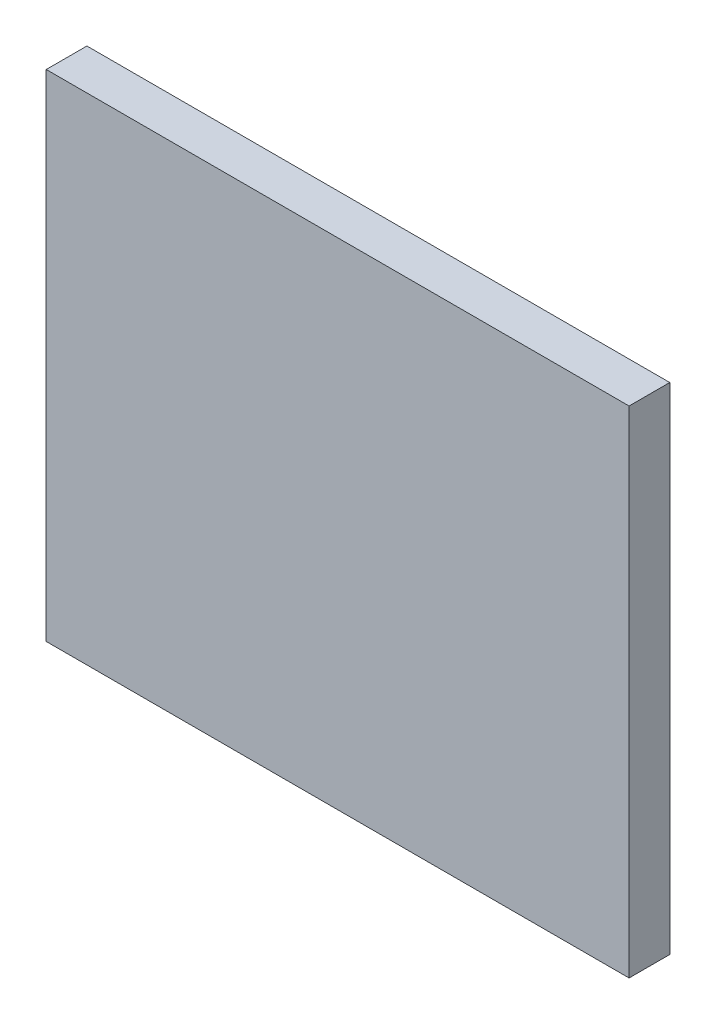
ISO-10303-21;
HEADER;
FILE_DESCRIPTION(('STEP AP214'),'2;1');
FILE_NAME('part.step','',(''),(''),'','','');
FILE_SCHEMA(('AUTOMOTIVE_DESIGN { 1 0 10303 214 1 1 1 1 }'));
ENDSEC;
DATA;
#1=APPLICATION_CONTEXT('core data for automotive mechanical design processes');
#2=APPLICATION_PROTOCOL_DEFINITION('international standard','automotive_design',2000,#1);
#3=PRODUCT_CONTEXT('',#1,'mechanical');
#4=PRODUCT('Part','Part','',(#3));
#5=PRODUCT_RELATED_PRODUCT_CATEGORY('part','',(#4));
#6=PRODUCT_DEFINITION_FORMATION('','',#4);
#7=PRODUCT_DEFINITION_CONTEXT('part definition',#1,'design');
#8=PRODUCT_DEFINITION('design','',#6,#7);
#9=PRODUCT_DEFINITION_SHAPE('','',#8);
#10=(LENGTH_UNIT() NAMED_UNIT(*) SI_UNIT(.MILLI.,.METRE.));
#11=(NAMED_UNIT(*) PLANE_ANGLE_UNIT() SI_UNIT($,.RADIAN.));
#12=(NAMED_UNIT(*) SI_UNIT($,.STERADIAN.) SOLID_ANGLE_UNIT());
#13=UNCERTAINTY_MEASURE_WITH_UNIT(LENGTH_MEASURE(1.E-05),#10,'distance_accuracy_value','');
#14=(GEOMETRIC_REPRESENTATION_CONTEXT(3) GLOBAL_UNCERTAINTY_ASSIGNED_CONTEXT((#13)) GLOBAL_UNIT_ASSIGNED_CONTEXT((#10,
#11,#12)) REPRESENTATION_CONTEXT('',''));
#15=CARTESIAN_POINT('',(0.,0.,0.));
#16=DIRECTION('',(0.,0.,1.));
#17=DIRECTION('',(1.,0.,0.));
#18=AXIS2_PLACEMENT_3D('',#15,#16,#17);
#19=CARTESIAN_POINT('',(0.,0.,2.79));
#20=DIRECTION('',(1.,0.,0.));
#21=DIRECTION('',(0.,0.,-1.));
#22=AXIS2_PLACEMENT_3D('',#19,#20,#21);
#23=PLANE('',#22);
#24=DIRECTION('',(0.,-1.,0.));
#25=VECTOR('',#24,1.);
#26=CARTESIAN_POINT('',(0.,0.,0.));
#27=LINE('',#26,#25);
#28=CARTESIAN_POINT('',(0.,33.98,0.));
#29=VERTEX_POINT('',#28);
#30=CARTESIAN_POINT('',(0.,0.,0.));
#31=VERTEX_POINT('',#30);
#32=EDGE_CURVE('E98',#29,#31,#27,.T.);
#33=ORIENTED_EDGE('',*,*,#32,.T.);
#34=DIRECTION('',(0.,0.,-1.));
#35=VECTOR('',#34,1.);
#36=CARTESIAN_POINT('',(0.,0.,2.79));
#37=LINE('',#36,#35);
#38=CARTESIAN_POINT('',(0.,0.,2.79));
#39=VERTEX_POINT('',#38);
#40=EDGE_CURVE('E11',#39,#31,#37,.T.);
#41=ORIENTED_EDGE('',*,*,#40,.F.);
#42=DIRECTION('',(0.,-1.,0.));
#43=VECTOR('',#42,1.);
#44=CARTESIAN_POINT('',(0.,0.,2.79));
#45=LINE('',#44,#43);
#46=CARTESIAN_POINT('',(0.,33.98,2.79));
#47=VERTEX_POINT('',#46);
#48=EDGE_CURVE('E86',#47,#39,#45,.T.);
#49=ORIENTED_EDGE('',*,*,#48,.F.);
#50=DIRECTION('',(0.,0.,-1.));
#51=VECTOR('',#50,1.);
#52=CARTESIAN_POINT('',(0.,33.98,2.79));
#53=LINE('',#52,#51);
#54=EDGE_CURVE('E94',#47,#29,#53,.T.);
#55=ORIENTED_EDGE('',*,*,#54,.T.);
#56=EDGE_LOOP('',(#33,#41,#49,#55));
#57=FACE_BOUND('',#56,.T.);
#58=ADVANCED_FACE('F35',(#57),#23,.F.);
#59=CARTESIAN_POINT('',(0.,0.,2.79));
#60=DIRECTION('',(0.,1.,0.));
#61=DIRECTION('',(0.,0.,1.));
#62=AXIS2_PLACEMENT_3D('',#59,#60,#61);
#63=PLANE('',#62);
#64=DIRECTION('',(1.,0.,0.));
#65=VECTOR('',#64,1.);
#66=CARTESIAN_POINT('',(0.,0.,0.));
#67=LINE('',#66,#65);
#68=CARTESIAN_POINT('',(39.98,0.,0.));
#69=VERTEX_POINT('',#68);
#70=EDGE_CURVE('E90',#31,#69,#67,.T.);
#71=ORIENTED_EDGE('',*,*,#70,.T.);
#72=DIRECTION('',(0.,0.,-1.));
#73=VECTOR('',#72,1.);
#74=CARTESIAN_POINT('',(39.98,0.,2.79));
#75=LINE('',#74,#73);
#76=CARTESIAN_POINT('',(39.98,0.,2.79));
#77=VERTEX_POINT('',#76);
#78=EDGE_CURVE('E43',#77,#69,#75,.T.);
#79=ORIENTED_EDGE('',*,*,#78,.F.);
#80=DIRECTION('',(1.,0.,0.));
#81=VECTOR('',#80,1.);
#82=CARTESIAN_POINT('',(0.,0.,2.79));
#83=LINE('',#82,#81);
#84=EDGE_CURVE('E81',#39,#77,#83,.T.);
#85=ORIENTED_EDGE('',*,*,#84,.F.);
#86=ORIENTED_EDGE('',*,*,#40,.T.);
#87=EDGE_LOOP('',(#71,#79,#85,#86));
#88=FACE_BOUND('',#87,.T.);
#89=ADVANCED_FACE('F89',(#88),#63,.F.);
#90=CARTESIAN_POINT('',(39.98,0.,2.79));
#91=DIRECTION('',(-1.,0.,0.));
#92=DIRECTION('',(0.,0.,1.));
#93=AXIS2_PLACEMENT_3D('',#90,#91,#92);
#94=PLANE('',#93);
#95=DIRECTION('',(0.,1.,0.));
#96=VECTOR('',#95,1.);
#97=CARTESIAN_POINT('',(39.98,0.,0.));
#98=LINE('',#97,#96);
#99=CARTESIAN_POINT('',(39.98,33.98,0.));
#100=VERTEX_POINT('',#99);
#101=EDGE_CURVE('E68',#69,#100,#98,.T.);
#102=ORIENTED_EDGE('',*,*,#101,.T.);
#103=DIRECTION('',(0.,0.,-1.));
#104=VECTOR('',#103,1.);
#105=CARTESIAN_POINT('',(39.98,33.98,2.79));
#106=LINE('',#105,#104);
#107=CARTESIAN_POINT('',(39.98,33.98,2.79));
#108=VERTEX_POINT('',#107);
#109=EDGE_CURVE('E91',#108,#100,#106,.T.);
#110=ORIENTED_EDGE('',*,*,#109,.F.);
#111=DIRECTION('',(0.,1.,0.));
#112=VECTOR('',#111,1.);
#113=CARTESIAN_POINT('',(39.98,0.,2.79));
#114=LINE('',#113,#112);
#115=EDGE_CURVE('E84',#77,#108,#114,.T.);
#116=ORIENTED_EDGE('',*,*,#115,.F.);
#117=ORIENTED_EDGE('',*,*,#78,.T.);
#118=EDGE_LOOP('',(#102,#110,#116,#117));
#119=FACE_BOUND('',#118,.T.);
#120=ADVANCED_FACE('F92',(#119),#94,.F.);
#121=CARTESIAN_POINT('',(0.,33.98,2.79));
#122=DIRECTION('',(0.,-1.,0.));
#123=DIRECTION('',(0.,0.,-1.));
#124=AXIS2_PLACEMENT_3D('',#121,#122,#123);
#125=PLANE('',#124);
#126=DIRECTION('',(-1.,0.,0.));
#127=VECTOR('',#126,1.);
#128=CARTESIAN_POINT('',(0.,33.98,0.));
#129=LINE('',#128,#127);
#130=EDGE_CURVE('E74',#100,#29,#129,.T.);
#131=ORIENTED_EDGE('',*,*,#130,.T.);
#132=ORIENTED_EDGE('',*,*,#54,.F.);
#133=DIRECTION('',(-1.,0.,0.));
#134=VECTOR('',#133,1.);
#135=CARTESIAN_POINT('',(0.,33.98,2.79));
#136=LINE('',#135,#134);
#137=EDGE_CURVE('E51',#108,#47,#136,.T.);
#138=ORIENTED_EDGE('',*,*,#137,.F.);
#139=ORIENTED_EDGE('',*,*,#109,.T.);
#140=EDGE_LOOP('',(#131,#132,#138,#139));
#141=FACE_BOUND('',#140,.T.);
#142=ADVANCED_FACE('F105',(#141),#125,.F.);
#143=CARTESIAN_POINT('',(0.,0.,2.79));
#144=DIRECTION('',(0.,0.,-1.));
#145=DIRECTION('',(-1.,0.,0.));
#146=AXIS2_PLACEMENT_3D('',#143,#144,#145);
#147=PLANE('',#146);
#148=ORIENTED_EDGE('',*,*,#48,.T.);
#149=ORIENTED_EDGE('',*,*,#84,.T.);
#150=ORIENTED_EDGE('',*,*,#115,.T.);
#151=ORIENTED_EDGE('',*,*,#137,.T.);
#152=EDGE_LOOP('',(#148,#149,#150,#151));
#153=FACE_BOUND('',#152,.T.);
#154=ADVANCED_FACE('F82',(#153),#147,.F.);
#155=CARTESIAN_POINT('',(0.,0.,0.));
#156=DIRECTION('',(0.,0.,-1.));
#157=DIRECTION('',(-1.,0.,0.));
#158=AXIS2_PLACEMENT_3D('',#155,#156,#157);
#159=PLANE('',#158);
#160=ORIENTED_EDGE('',*,*,#32,.F.);
#161=ORIENTED_EDGE('',*,*,#130,.F.);
#162=ORIENTED_EDGE('',*,*,#101,.F.);
#163=ORIENTED_EDGE('',*,*,#70,.F.);
#164=EDGE_LOOP('',(#160,#161,#162,#163));
#165=FACE_BOUND('',#164,.T.);
#166=ADVANCED_FACE('F108',(#165),#159,.T.);
#167=CLOSED_SHELL('',(#58,#89,#120,#142,#154,#166));
#168=MANIFOLD_SOLID_BREP('B2',#167);
#169=ADVANCED_BREP_SHAPE_REPRESENTATION('',(#18,#168),#14);
#170=SHAPE_DEFINITION_REPRESENTATION(#9,#169);
ENDSEC;
END-ISO-10303-21;
